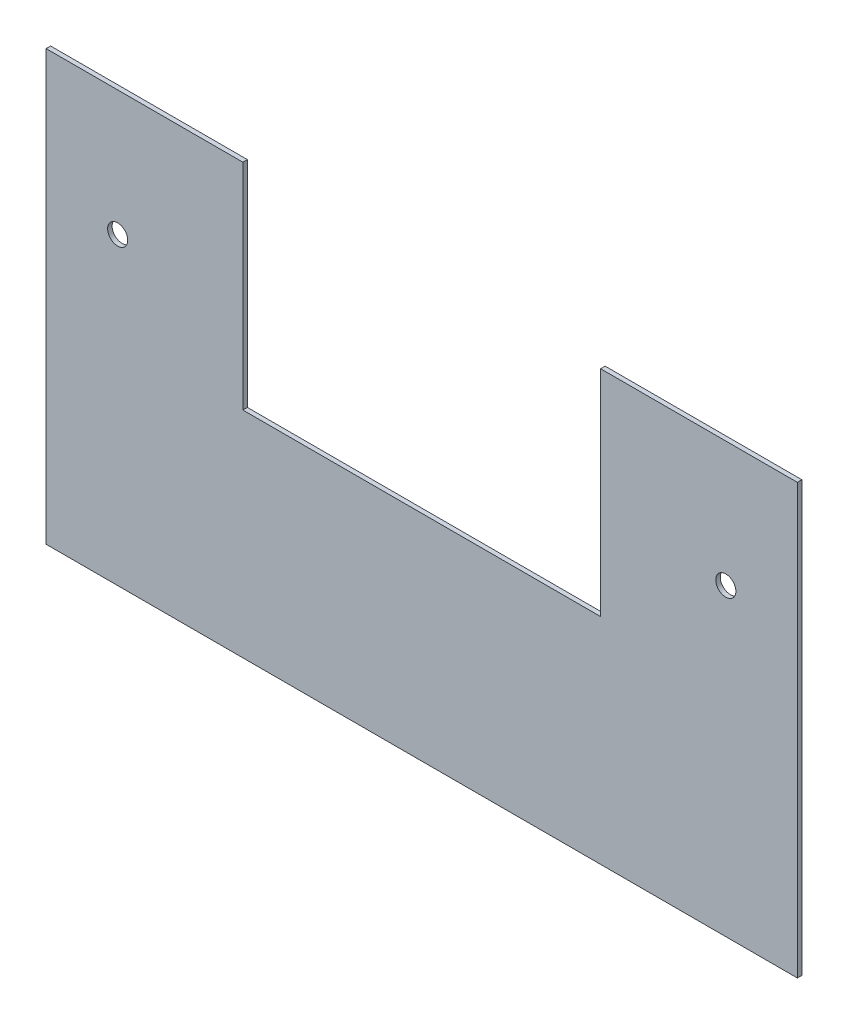
ISO-10303-21;
HEADER;
FILE_DESCRIPTION(('STEP AP214'),'2;1');
FILE_NAME('part.step','',(''),(''),'','','');
FILE_SCHEMA(('AUTOMOTIVE_DESIGN { 1 0 10303 214 1 1 1 1 }'));
ENDSEC;
DATA;
#1=APPLICATION_CONTEXT('core data for automotive mechanical design processes');
#2=APPLICATION_PROTOCOL_DEFINITION('international standard','automotive_design',2000,#1);
#3=PRODUCT_CONTEXT('',#1,'mechanical');
#4=PRODUCT('Part','Part','',(#3));
#5=PRODUCT_RELATED_PRODUCT_CATEGORY('part','',(#4));
#6=PRODUCT_DEFINITION_FORMATION('','',#4);
#7=PRODUCT_DEFINITION_CONTEXT('part definition',#1,'design');
#8=PRODUCT_DEFINITION('design','',#6,#7);
#9=PRODUCT_DEFINITION_SHAPE('','',#8);
#10=(LENGTH_UNIT() NAMED_UNIT(*) SI_UNIT(.MILLI.,.METRE.));
#11=(NAMED_UNIT(*) PLANE_ANGLE_UNIT() SI_UNIT($,.RADIAN.));
#12=(NAMED_UNIT(*) SI_UNIT($,.STERADIAN.) SOLID_ANGLE_UNIT());
#13=UNCERTAINTY_MEASURE_WITH_UNIT(LENGTH_MEASURE(1.E-05),#10,'distance_accuracy_value','');
#14=(GEOMETRIC_REPRESENTATION_CONTEXT(3) GLOBAL_UNCERTAINTY_ASSIGNED_CONTEXT((#13)) GLOBAL_UNIT_ASSIGNED_CONTEXT((#10,
#11,#12)) REPRESENTATION_CONTEXT('',''));
#15=CARTESIAN_POINT('',(0.,0.,0.));
#16=DIRECTION('',(0.,0.,1.));
#17=DIRECTION('',(1.,0.,0.));
#18=AXIS2_PLACEMENT_3D('',#15,#16,#17);
#19=CARTESIAN_POINT('',(133.35,76.2,1.6002));
#20=DIRECTION('',(-1.,0.,0.));
#21=DIRECTION('',(0.,-1.,0.));
#22=AXIS2_PLACEMENT_3D('',#19,#20,#21);
#23=PLANE('',#22);
#24=DIRECTION('',(0.,1.,0.));
#25=VECTOR('',#24,1.);
#26=CARTESIAN_POINT('',(133.35,76.2,0.));
#27=LINE('',#26,#25);
#28=CARTESIAN_POINT('',(133.35,-76.2,0.));
#29=VERTEX_POINT('',#28);
#30=CARTESIAN_POINT('',(133.35,76.2,0.));
#31=VERTEX_POINT('',#30);
#32=EDGE_CURVE('E131',#29,#31,#27,.T.);
#33=ORIENTED_EDGE('',*,*,#32,.T.);
#34=DIRECTION('',(0.,0.,-1.));
#35=VECTOR('',#34,1.);
#36=CARTESIAN_POINT('',(133.35,76.2,1.6002));
#37=LINE('',#36,#35);
#38=CARTESIAN_POINT('',(133.35,76.2,1.6002));
#39=VERTEX_POINT('',#38);
#40=EDGE_CURVE('E11',#39,#31,#37,.T.);
#41=ORIENTED_EDGE('',*,*,#40,.F.);
#42=DIRECTION('',(0.,1.,0.));
#43=VECTOR('',#42,1.);
#44=CARTESIAN_POINT('',(133.35,76.2,1.6002));
#45=LINE('',#44,#43);
#46=CARTESIAN_POINT('',(133.35,-76.2,1.6002));
#47=VERTEX_POINT('',#46);
#48=EDGE_CURVE('E146',#47,#39,#45,.T.);
#49=ORIENTED_EDGE('',*,*,#48,.F.);
#50=DIRECTION('',(0.,0.,-1.));
#51=VECTOR('',#50,1.);
#52=CARTESIAN_POINT('',(133.35,-76.2,1.6002));
#53=LINE('',#52,#51);
#54=EDGE_CURVE('E127',#47,#29,#53,.T.);
#55=ORIENTED_EDGE('',*,*,#54,.T.);
#56=EDGE_LOOP('',(#33,#41,#49,#55));
#57=FACE_BOUND('',#56,.T.);
#58=ADVANCED_FACE('F35',(#57),#23,.F.);
#59=CARTESIAN_POINT('',(63.5,76.2,1.6002));
#60=DIRECTION('',(0.,-1.,0.));
#61=DIRECTION('',(0.,0.,-1.));
#62=AXIS2_PLACEMENT_3D('',#59,#60,#61);
#63=PLANE('',#62);
#64=DIRECTION('',(-1.,0.,0.));
#65=VECTOR('',#64,1.);
#66=CARTESIAN_POINT('',(63.5,76.2,0.));
#67=LINE('',#66,#65);
#68=CARTESIAN_POINT('',(63.5,76.2,0.));
#69=VERTEX_POINT('',#68);
#70=EDGE_CURVE('E134',#31,#69,#67,.T.);
#71=ORIENTED_EDGE('',*,*,#70,.T.);
#72=DIRECTION('',(0.,0.,-1.));
#73=VECTOR('',#72,1.);
#74=CARTESIAN_POINT('',(63.5,76.2,1.6002));
#75=LINE('',#74,#73);
#76=CARTESIAN_POINT('',(63.5,76.2,1.6002));
#77=VERTEX_POINT('',#76);
#78=EDGE_CURVE('E43',#77,#69,#75,.T.);
#79=ORIENTED_EDGE('',*,*,#78,.F.);
#80=DIRECTION('',(-1.,0.,0.));
#81=VECTOR('',#80,1.);
#82=CARTESIAN_POINT('',(63.5,76.2,1.6002));
#83=LINE('',#82,#81);
#84=EDGE_CURVE('E94',#39,#77,#83,.T.);
#85=ORIENTED_EDGE('',*,*,#84,.F.);
#86=ORIENTED_EDGE('',*,*,#40,.T.);
#87=EDGE_LOOP('',(#71,#79,#85,#86));
#88=FACE_BOUND('',#87,.T.);
#89=ADVANCED_FACE('F213',(#88),#63,.F.);
#90=CARTESIAN_POINT('',(63.5,76.2,1.6002));
#91=DIRECTION('',(1.,0.,0.));
#92=DIRECTION('',(0.,1.,0.));
#93=AXIS2_PLACEMENT_3D('',#90,#91,#92);
#94=PLANE('',#93);
#95=DIRECTION('',(0.,-1.,0.));
#96=VECTOR('',#95,1.);
#97=CARTESIAN_POINT('',(63.5,76.2,0.));
#98=LINE('',#97,#96);
#99=CARTESIAN_POINT('',(63.5,0.,0.));
#100=VERTEX_POINT('',#99);
#101=EDGE_CURVE('E137',#69,#100,#98,.T.);
#102=ORIENTED_EDGE('',*,*,#101,.T.);
#103=DIRECTION('',(0.,0.,-1.));
#104=VECTOR('',#103,1.);
#105=CARTESIAN_POINT('',(63.5,0.,1.6002));
#106=LINE('',#105,#104);
#107=CARTESIAN_POINT('',(63.5,0.,1.6002));
#108=VERTEX_POINT('',#107);
#109=EDGE_CURVE('E153',#108,#100,#106,.T.);
#110=ORIENTED_EDGE('',*,*,#109,.F.);
#111=DIRECTION('',(0.,-1.,0.));
#112=VECTOR('',#111,1.);
#113=CARTESIAN_POINT('',(63.5,76.2,1.6002));
#114=LINE('',#113,#112);
#115=EDGE_CURVE('E161',#77,#108,#114,.T.);
#116=ORIENTED_EDGE('',*,*,#115,.F.);
#117=ORIENTED_EDGE('',*,*,#78,.T.);
#118=EDGE_LOOP('',(#102,#110,#116,#117));
#119=FACE_BOUND('',#118,.T.);
#120=ADVANCED_FACE('F159',(#119),#94,.F.);
#121=CARTESIAN_POINT('',(-63.5,0.,1.6002));
#122=DIRECTION('',(0.,-1.,0.));
#123=DIRECTION('',(0.,0.,-1.));
#124=AXIS2_PLACEMENT_3D('',#121,#122,#123);
#125=PLANE('',#124);
#126=DIRECTION('',(-1.,0.,0.));
#127=VECTOR('',#126,1.);
#128=CARTESIAN_POINT('',(-63.5,0.,0.));
#129=LINE('',#128,#127);
#130=CARTESIAN_POINT('',(-63.5,0.,0.));
#131=VERTEX_POINT('',#130);
#132=EDGE_CURVE('E139',#100,#131,#129,.T.);
#133=ORIENTED_EDGE('',*,*,#132,.T.);
#134=DIRECTION('',(0.,0.,-1.));
#135=VECTOR('',#134,1.);
#136=CARTESIAN_POINT('',(-63.5,0.,1.6002));
#137=LINE('',#136,#135);
#138=CARTESIAN_POINT('',(-63.5,0.,1.6002));
#139=VERTEX_POINT('',#138);
#140=EDGE_CURVE('E150',#139,#131,#137,.T.);
#141=ORIENTED_EDGE('',*,*,#140,.F.);
#142=DIRECTION('',(-1.,0.,0.));
#143=VECTOR('',#142,1.);
#144=CARTESIAN_POINT('',(-63.5,0.,1.6002));
#145=LINE('',#144,#143);
#146=EDGE_CURVE('E173',#108,#139,#145,.T.);
#147=ORIENTED_EDGE('',*,*,#146,.F.);
#148=ORIENTED_EDGE('',*,*,#109,.T.);
#149=EDGE_LOOP('',(#133,#141,#147,#148));
#150=FACE_BOUND('',#149,.T.);
#151=ADVANCED_FACE('F169',(#150),#125,.F.);
#152=CARTESIAN_POINT('',(-63.5,76.2,1.6002));
#153=DIRECTION('',(-1.,0.,0.));
#154=DIRECTION('',(0.,-1.,0.));
#155=AXIS2_PLACEMENT_3D('',#152,#153,#154);
#156=PLANE('',#155);
#157=DIRECTION('',(0.,1.,0.));
#158=VECTOR('',#157,1.);
#159=CARTESIAN_POINT('',(-63.5,76.2,0.));
#160=LINE('',#159,#158);
#161=CARTESIAN_POINT('',(-63.5,76.2,0.));
#162=VERTEX_POINT('',#161);
#163=EDGE_CURVE('E141',#131,#162,#160,.T.);
#164=ORIENTED_EDGE('',*,*,#163,.T.);
#165=DIRECTION('',(0.,0.,-1.));
#166=VECTOR('',#165,1.);
#167=CARTESIAN_POINT('',(-63.5,76.2,1.6002));
#168=LINE('',#167,#166);
#169=CARTESIAN_POINT('',(-63.5,76.2,1.6002));
#170=VERTEX_POINT('',#169);
#171=EDGE_CURVE('E122',#170,#162,#168,.T.);
#172=ORIENTED_EDGE('',*,*,#171,.F.);
#173=DIRECTION('',(0.,1.,0.));
#174=VECTOR('',#173,1.);
#175=CARTESIAN_POINT('',(-63.5,76.2,1.6002));
#176=LINE('',#175,#174);
#177=EDGE_CURVE('E113',#139,#170,#176,.T.);
#178=ORIENTED_EDGE('',*,*,#177,.F.);
#179=ORIENTED_EDGE('',*,*,#140,.T.);
#180=EDGE_LOOP('',(#164,#172,#178,#179));
#181=FACE_BOUND('',#180,.T.);
#182=ADVANCED_FACE('F172',(#181),#156,.F.);
#183=CARTESIAN_POINT('',(-133.35,76.2,1.6002));
#184=DIRECTION('',(0.,-1.,0.));
#185=DIRECTION('',(0.,0.,-1.));
#186=AXIS2_PLACEMENT_3D('',#183,#184,#185);
#187=PLANE('',#186);
#188=DIRECTION('',(-1.,0.,0.));
#189=VECTOR('',#188,1.);
#190=CARTESIAN_POINT('',(-133.35,76.2,0.));
#191=LINE('',#190,#189);
#192=CARTESIAN_POINT('',(-133.35,76.2,0.));
#193=VERTEX_POINT('',#192);
#194=EDGE_CURVE('E121',#162,#193,#191,.T.);
#195=ORIENTED_EDGE('',*,*,#194,.T.);
#196=DIRECTION('',(0.,0.,-1.));
#197=VECTOR('',#196,1.);
#198=CARTESIAN_POINT('',(-133.35,76.2,1.6002));
#199=LINE('',#198,#197);
#200=CARTESIAN_POINT('',(-133.35,76.2,1.6002));
#201=VERTEX_POINT('',#200);
#202=EDGE_CURVE('E118',#201,#193,#199,.T.);
#203=ORIENTED_EDGE('',*,*,#202,.F.);
#204=DIRECTION('',(-1.,0.,0.));
#205=VECTOR('',#204,1.);
#206=CARTESIAN_POINT('',(-133.35,76.2,1.6002));
#207=LINE('',#206,#205);
#208=EDGE_CURVE('E107',#170,#201,#207,.T.);
#209=ORIENTED_EDGE('',*,*,#208,.F.);
#210=ORIENTED_EDGE('',*,*,#171,.T.);
#211=EDGE_LOOP('',(#195,#203,#209,#210));
#212=FACE_BOUND('',#211,.T.);
#213=ADVANCED_FACE('F119',(#212),#187,.F.);
#214=CARTESIAN_POINT('',(-133.35,76.2,1.6002));
#215=DIRECTION('',(1.,0.,0.));
#216=DIRECTION('',(0.,1.,0.));
#217=AXIS2_PLACEMENT_3D('',#214,#215,#216);
#218=PLANE('',#217);
#219=DIRECTION('',(0.,-1.,0.));
#220=VECTOR('',#219,1.);
#221=CARTESIAN_POINT('',(-133.35,76.2,0.));
#222=LINE('',#221,#220);
#223=CARTESIAN_POINT('',(-133.35,-76.2,0.));
#224=VERTEX_POINT('',#223);
#225=EDGE_CURVE('E80',#193,#224,#222,.T.);
#226=ORIENTED_EDGE('',*,*,#225,.T.);
#227=DIRECTION('',(0.,0.,-1.));
#228=VECTOR('',#227,1.);
#229=CARTESIAN_POINT('',(-133.35,-76.2,1.6002));
#230=LINE('',#229,#228);
#231=CARTESIAN_POINT('',(-133.35,-76.2,1.6002));
#232=VERTEX_POINT('',#231);
#233=EDGE_CURVE('E123',#232,#224,#230,.T.);
#234=ORIENTED_EDGE('',*,*,#233,.F.);
#235=DIRECTION('',(0.,-1.,0.));
#236=VECTOR('',#235,1.);
#237=CARTESIAN_POINT('',(-133.35,76.2,1.6002));
#238=LINE('',#237,#236);
#239=EDGE_CURVE('E111',#201,#232,#238,.T.);
#240=ORIENTED_EDGE('',*,*,#239,.F.);
#241=ORIENTED_EDGE('',*,*,#202,.T.);
#242=EDGE_LOOP('',(#226,#234,#240,#241));
#243=FACE_BOUND('',#242,.T.);
#244=ADVANCED_FACE('F125',(#243),#218,.F.);
#245=CARTESIAN_POINT('',(-133.35,-76.2,1.6002));
#246=DIRECTION('',(0.,1.,0.));
#247=DIRECTION('',(0.,0.,1.));
#248=AXIS2_PLACEMENT_3D('',#245,#246,#247);
#249=PLANE('',#248);
#250=DIRECTION('',(1.,0.,0.));
#251=VECTOR('',#250,1.);
#252=CARTESIAN_POINT('',(-133.35,-76.2,0.));
#253=LINE('',#252,#251);
#254=EDGE_CURVE('E86',#224,#29,#253,.T.);
#255=ORIENTED_EDGE('',*,*,#254,.T.);
#256=ORIENTED_EDGE('',*,*,#54,.F.);
#257=DIRECTION('',(1.,0.,0.));
#258=VECTOR('',#257,1.);
#259=CARTESIAN_POINT('',(-133.35,-76.2,1.6002));
#260=LINE('',#259,#258);
#261=EDGE_CURVE('E51',#232,#47,#260,.T.);
#262=ORIENTED_EDGE('',*,*,#261,.F.);
#263=ORIENTED_EDGE('',*,*,#233,.T.);
#264=EDGE_LOOP('',(#255,#256,#262,#263));
#265=FACE_BOUND('',#264,.T.);
#266=ADVANCED_FACE('F195',(#265),#249,.F.);
#267=CARTESIAN_POINT('',(0.,0.,1.6002));
#268=DIRECTION('',(0.,0.,1.));
#269=DIRECTION('',(1.,0.,0.));
#270=AXIS2_PLACEMENT_3D('',#267,#268,#269);
#271=PLANE('',#270);
#272=CARTESIAN_POINT('',(-107.95,31.75,1.6002));
#273=DIRECTION('',(0.,0.,1.));
#274=DIRECTION('',(1.,0.,0.));
#275=AXIS2_PLACEMENT_3D('',#272,#273,#274);
#276=CIRCLE('',#275,3.57124);
#277=CARTESIAN_POINT('',(-104.37876,31.75,1.6002));
#278=VERTEX_POINT('',#277);
#279=EDGE_CURVE('E187',#278,#278,#276,.T.);
#280=ORIENTED_EDGE('',*,*,#279,.F.);
#281=EDGE_LOOP('',(#280));
#282=FACE_BOUND('',#281,.T.);
#283=CARTESIAN_POINT('',(107.95,31.75,1.6002));
#284=DIRECTION('',(0.,0.,1.));
#285=DIRECTION('',(1.,0.,0.));
#286=AXIS2_PLACEMENT_3D('',#283,#284,#285);
#287=CIRCLE('',#286,3.57124);
#288=CARTESIAN_POINT('',(111.52124,31.75,1.6002));
#289=VERTEX_POINT('',#288);
#290=EDGE_CURVE('E181',#289,#289,#287,.T.);
#291=ORIENTED_EDGE('',*,*,#290,.F.);
#292=EDGE_LOOP('',(#291));
#293=FACE_BOUND('',#292,.T.);
#294=ORIENTED_EDGE('',*,*,#48,.T.);
#295=ORIENTED_EDGE('',*,*,#84,.T.);
#296=ORIENTED_EDGE('',*,*,#115,.T.);
#297=ORIENTED_EDGE('',*,*,#146,.T.);
#298=ORIENTED_EDGE('',*,*,#177,.T.);
#299=ORIENTED_EDGE('',*,*,#208,.T.);
#300=ORIENTED_EDGE('',*,*,#239,.T.);
#301=ORIENTED_EDGE('',*,*,#261,.T.);
#302=EDGE_LOOP('',(#294,#295,#296,#297,#298,#299,#300,#301));
#303=FACE_BOUND('',#302,.T.);
#304=ADVANCED_FACE('F109',(#282,#293,#303),#271,.T.);
#305=CARTESIAN_POINT('',(0.,0.,0.));
#306=DIRECTION('',(0.,0.,1.));
#307=DIRECTION('',(1.,0.,0.));
#308=AXIS2_PLACEMENT_3D('',#305,#306,#307);
#309=PLANE('',#308);
#310=CARTESIAN_POINT('',(-107.95,31.75,0.));
#311=DIRECTION('',(0.,0.,1.));
#312=DIRECTION('',(1.,0.,0.));
#313=AXIS2_PLACEMENT_3D('',#310,#311,#312);
#314=CIRCLE('',#313,3.57124);
#315=CARTESIAN_POINT('',(-104.37876,31.75,0.));
#316=VERTEX_POINT('',#315);
#317=EDGE_CURVE('E184',#316,#316,#314,.T.);
#318=ORIENTED_EDGE('',*,*,#317,.T.);
#319=EDGE_LOOP('',(#318));
#320=FACE_BOUND('',#319,.T.);
#321=CARTESIAN_POINT('',(107.95,31.75,0.));
#322=DIRECTION('',(0.,0.,1.));
#323=DIRECTION('',(1.,0.,0.));
#324=AXIS2_PLACEMENT_3D('',#321,#322,#323);
#325=CIRCLE('',#324,3.57124);
#326=CARTESIAN_POINT('',(111.52124,31.75,0.));
#327=VERTEX_POINT('',#326);
#328=EDGE_CURVE('E135',#327,#327,#325,.T.);
#329=ORIENTED_EDGE('',*,*,#328,.T.);
#330=EDGE_LOOP('',(#329));
#331=FACE_BOUND('',#330,.T.);
#332=ORIENTED_EDGE('',*,*,#32,.F.);
#333=ORIENTED_EDGE('',*,*,#254,.F.);
#334=ORIENTED_EDGE('',*,*,#225,.F.);
#335=ORIENTED_EDGE('',*,*,#194,.F.);
#336=ORIENTED_EDGE('',*,*,#163,.F.);
#337=ORIENTED_EDGE('',*,*,#132,.F.);
#338=ORIENTED_EDGE('',*,*,#101,.F.);
#339=ORIENTED_EDGE('',*,*,#70,.F.);
#340=EDGE_LOOP('',(#332,#333,#334,#335,#336,#337,#338,#339));
#341=FACE_BOUND('',#340,.T.);
#342=ADVANCED_FACE('F165',(#320,#331,#341),#309,.F.);
#343=CARTESIAN_POINT('',(107.95,31.75,1.6002));
#344=DIRECTION('',(0.,0.,1.));
#345=DIRECTION('',(1.,0.,0.));
#346=AXIS2_PLACEMENT_3D('',#343,#344,#345);
#347=CYLINDRICAL_SURFACE('',#346,3.57124);
#348=ORIENTED_EDGE('',*,*,#328,.F.);
#349=EDGE_LOOP('',(#348));
#350=FACE_BOUND('',#349,.T.);
#351=ORIENTED_EDGE('',*,*,#290,.T.);
#352=EDGE_LOOP('',(#351));
#353=FACE_BOUND('',#352,.T.);
#354=ADVANCED_FACE('F199',(#350,#353),#347,.F.);
#355=CARTESIAN_POINT('',(-107.95,31.75,1.6002));
#356=DIRECTION('',(0.,0.,1.));
#357=DIRECTION('',(1.,0.,0.));
#358=AXIS2_PLACEMENT_3D('',#355,#356,#357);
#359=CYLINDRICAL_SURFACE('',#358,3.57124);
#360=ORIENTED_EDGE('',*,*,#317,.F.);
#361=EDGE_LOOP('',(#360));
#362=FACE_BOUND('',#361,.T.);
#363=ORIENTED_EDGE('',*,*,#279,.T.);
#364=EDGE_LOOP('',(#363));
#365=FACE_BOUND('',#364,.T.);
#366=ADVANCED_FACE('F191',(#362,#365),#359,.F.);
#367=CLOSED_SHELL('',(#58,#89,#120,#151,#182,#213,#244,#266,#304,#342,#354,#366));
#368=MANIFOLD_SOLID_BREP('B2',#367);
#369=ADVANCED_BREP_SHAPE_REPRESENTATION('',(#18,#368),#14);
#370=SHAPE_DEFINITION_REPRESENTATION(#9,#369);
ENDSEC;
END-ISO-10303-21;
